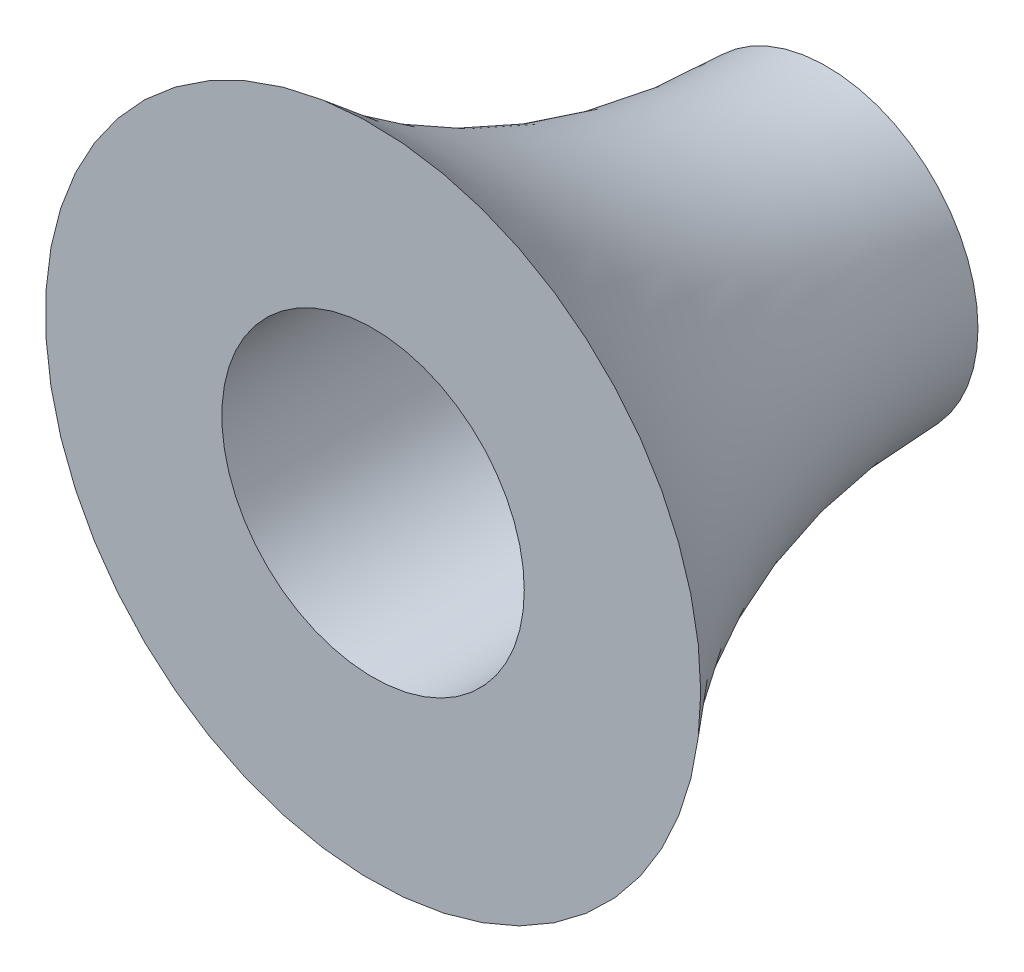
ISO-10303-21;
HEADER;
FILE_DESCRIPTION(('STEP AP214'),'2;1');
FILE_NAME('part.step','',(''),(''),'','','');
FILE_SCHEMA(('AUTOMOTIVE_DESIGN { 1 0 10303 214 1 1 1 1 }'));
ENDSEC;
DATA;
#1=APPLICATION_CONTEXT('core data for automotive mechanical design processes');
#2=APPLICATION_PROTOCOL_DEFINITION('international standard','automotive_design',2000,#1);
#3=PRODUCT_CONTEXT('',#1,'mechanical');
#4=PRODUCT('Part','Part','',(#3));
#5=PRODUCT_RELATED_PRODUCT_CATEGORY('part','',(#4));
#6=PRODUCT_DEFINITION_FORMATION('','',#4);
#7=PRODUCT_DEFINITION_CONTEXT('part definition',#1,'design');
#8=PRODUCT_DEFINITION('design','',#6,#7);
#9=PRODUCT_DEFINITION_SHAPE('','',#8);
#10=(LENGTH_UNIT() NAMED_UNIT(*) SI_UNIT(.MILLI.,.METRE.));
#11=(NAMED_UNIT(*) PLANE_ANGLE_UNIT() SI_UNIT($,.RADIAN.));
#12=(NAMED_UNIT(*) SI_UNIT($,.STERADIAN.) SOLID_ANGLE_UNIT());
#13=UNCERTAINTY_MEASURE_WITH_UNIT(LENGTH_MEASURE(1.E-05),#10,'distance_accuracy_value','');
#14=(GEOMETRIC_REPRESENTATION_CONTEXT(3) GLOBAL_UNCERTAINTY_ASSIGNED_CONTEXT((#13)) GLOBAL_UNIT_ASSIGNED_CONTEXT((#10,
#11,#12)) REPRESENTATION_CONTEXT('',''));
#15=CARTESIAN_POINT('',(0.,0.,0.));
#16=DIRECTION('',(0.,0.,1.));
#17=DIRECTION('',(1.,0.,0.));
#18=AXIS2_PLACEMENT_3D('',#15,#16,#17);
#19=CARTESIAN_POINT('',(-4.55805526532028,-5.08305526532028,-7.02));
#20=DIRECTION('',(0.,0.,1.));
#21=DIRECTION('',(1.,0.,0.));
#22=AXIS2_PLACEMENT_3D('',#19,#20,#21);
#23=PLANE('',#22);
#24=CARTESIAN_POINT('',(-3.675,-4.2,-7.02));
#25=DIRECTION('',(0.,0.,1.));
#26=DIRECTION('',(1.,0.,0.));
#27=AXIS2_PLACEMENT_3D('',#24,#25,#26);
#28=CIRCLE('',#27,0.299999999999999);
#29=CARTESIAN_POINT('',(-3.375,-4.2,-7.02));
#30=VERTEX_POINT('',#29);
#31=EDGE_CURVE('E19',#30,#30,#28,.T.);
#32=ORIENTED_EDGE('',*,*,#31,.F.);
#33=EDGE_LOOP('',(#32));
#34=FACE_BOUND('',#33,.T.);
#35=CARTESIAN_POINT('',(-3.675,-4.2,-7.01999999999981));
#36=DIRECTION('',(0.,0.,1.));
#37=DIRECTION('',(1.,0.,0.));
#38=AXIS2_PLACEMENT_3D('',#35,#36,#37);
#39=CIRCLE('',#38,0.650000000001198);
#40=CARTESIAN_POINT('',(-3.0249999999988,-4.2,-7.01999999999981));
#41=VERTEX_POINT('',#40);
#42=EDGE_CURVE('E23',#41,#41,#39,.F.);
#43=ORIENTED_EDGE('',*,*,#42,.F.);
#44=EDGE_LOOP('',(#43));
#45=FACE_BOUND('',#44,.T.);
#46=ADVANCED_FACE('F15',(#34,#45),#23,.T.);
#47=CARTESIAN_POINT('',(-3.675,-4.2,-7.92));
#48=DIRECTION('',(0.,0.,1.));
#49=DIRECTION('',(1.,0.,0.));
#50=AXIS2_PLACEMENT_3D('',#47,#48,#49);
#51=CYLINDRICAL_SURFACE('',#50,0.299999999999999);
#52=ORIENTED_EDGE('',*,*,#31,.T.);
#53=EDGE_LOOP('',(#52));
#54=FACE_BOUND('',#53,.T.);
#55=CARTESIAN_POINT('',(-3.675,-4.2,-7.92));
#56=DIRECTION('',(0.,0.,1.));
#57=DIRECTION('',(1.,0.,0.));
#58=AXIS2_PLACEMENT_3D('',#55,#56,#57);
#59=CIRCLE('',#58,0.299999999999999);
#60=CARTESIAN_POINT('',(-3.375,-4.2,-7.92));
#61=VERTEX_POINT('',#60);
#62=EDGE_CURVE('E10',#61,#61,#59,.T.);
#63=ORIENTED_EDGE('',*,*,#62,.F.);
#64=EDGE_LOOP('',(#63));
#65=FACE_BOUND('',#64,.T.);
#66=ADVANCED_FACE('F33',(#54,#65),#51,.F.);
#67=CARTESIAN_POINT('',(-3.675,-4.2,-7.92));
#68=DIRECTION('',(0.,0.,1.));
#69=DIRECTION('',(1.,0.,0.));
#70=AXIS2_PLACEMENT_3D('',#67,#68,#69);
#71=TOROIDAL_SURFACE('',#70,1.63214285713999,1.33214285713999);
#72=ORIENTED_EDGE('',*,*,#62,.T.);
#73=EDGE_LOOP('',(#72));
#74=FACE_BOUND('',#73,.T.);
#75=ORIENTED_EDGE('',*,*,#42,.T.);
#76=EDGE_LOOP('',(#75));
#77=FACE_BOUND('',#76,.T.);
#78=ADVANCED_FACE('F17',(#74,#77),#71,.F.);
#79=CLOSED_SHELL('',(#46,#66,#78));
#80=MANIFOLD_SOLID_BREP('B1',#79);
#81=ADVANCED_BREP_SHAPE_REPRESENTATION('',(#18,#80),#14);
#82=SHAPE_DEFINITION_REPRESENTATION(#9,#81);
ENDSEC;
END-ISO-10303-21;
